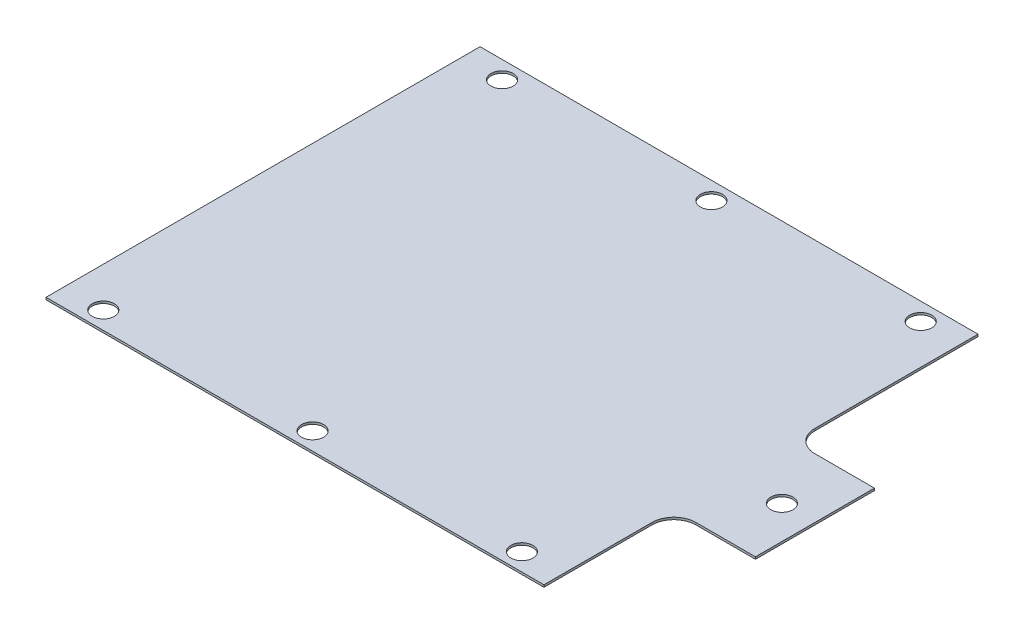
ISO-10303-21;
HEADER;
FILE_DESCRIPTION(('STEP AP214'),'2;1');
FILE_NAME('part.step','',(''),(''),'','','');
FILE_SCHEMA(('AUTOMOTIVE_DESIGN { 1 0 10303 214 1 1 1 1 }'));
ENDSEC;
DATA;
#1=APPLICATION_CONTEXT('core data for automotive mechanical design processes');
#2=APPLICATION_PROTOCOL_DEFINITION('international standard','automotive_design',2000,#1);
#3=PRODUCT_CONTEXT('',#1,'mechanical');
#4=PRODUCT('Part','Part','',(#3));
#5=PRODUCT_RELATED_PRODUCT_CATEGORY('part','',(#4));
#6=PRODUCT_DEFINITION_FORMATION('','',#4);
#7=PRODUCT_DEFINITION_CONTEXT('part definition',#1,'design');
#8=PRODUCT_DEFINITION('design','',#6,#7);
#9=PRODUCT_DEFINITION_SHAPE('','',#8);
#10=(LENGTH_UNIT() NAMED_UNIT(*) SI_UNIT(.MILLI.,.METRE.));
#11=(NAMED_UNIT(*) PLANE_ANGLE_UNIT() SI_UNIT($,.RADIAN.));
#12=(NAMED_UNIT(*) SI_UNIT($,.STERADIAN.) SOLID_ANGLE_UNIT());
#13=UNCERTAINTY_MEASURE_WITH_UNIT(LENGTH_MEASURE(1.E-05),#10,'distance_accuracy_value','');
#14=(GEOMETRIC_REPRESENTATION_CONTEXT(3) GLOBAL_UNCERTAINTY_ASSIGNED_CONTEXT((#13)) GLOBAL_UNIT_ASSIGNED_CONTEXT((#10,
#11,#12)) REPRESENTATION_CONTEXT('',''));
#15=CARTESIAN_POINT('',(0.,0.,0.));
#16=DIRECTION('',(0.,0.,1.));
#17=DIRECTION('',(1.,0.,0.));
#18=AXIS2_PLACEMENT_3D('',#15,#16,#17);
#19=CARTESIAN_POINT('',(0.,0.,0.));
#20=DIRECTION('',(0.,1.,0.));
#21=DIRECTION('',(0.,0.,1.));
#22=AXIS2_PLACEMENT_3D('',#19,#20,#21);
#23=PLANE('',#22);
#24=CARTESIAN_POINT('',(95.,0.,90.5));
#25=DIRECTION('',(0.,1.,0.));
#26=DIRECTION('',(0.,0.,1.));
#27=AXIS2_PLACEMENT_3D('',#24,#25,#26);
#28=CIRCLE('',#27,5.);
#29=CARTESIAN_POINT('',(95.,0.,95.5));
#30=VERTEX_POINT('',#29);
#31=EDGE_CURVE('E125',#30,#30,#28,.T.);
#32=ORIENTED_EDGE('',*,*,#31,.T.);
#33=EDGE_LOOP('',(#32));
#34=FACE_BOUND('',#33,.T.);
#35=CARTESIAN_POINT('',(0.,0.,90.5));
#36=DIRECTION('',(0.,1.,0.));
#37=DIRECTION('',(0.,0.,1.));
#38=AXIS2_PLACEMENT_3D('',#35,#36,#37);
#39=CIRCLE('',#38,5.);
#40=CARTESIAN_POINT('',(0.,0.,95.5));
#41=VERTEX_POINT('',#40);
#42=EDGE_CURVE('E201',#41,#41,#39,.T.);
#43=ORIENTED_EDGE('',*,*,#42,.T.);
#44=EDGE_LOOP('',(#43));
#45=FACE_BOUND('',#44,.T.);
#46=CARTESIAN_POINT('',(-95.,0.,90.5));
#47=DIRECTION('',(0.,1.,0.));
#48=DIRECTION('',(0.,0.,1.));
#49=AXIS2_PLACEMENT_3D('',#46,#47,#48);
#50=CIRCLE('',#49,5.);
#51=CARTESIAN_POINT('',(-95.,0.,95.5));
#52=VERTEX_POINT('',#51);
#53=EDGE_CURVE('E204',#52,#52,#50,.T.);
#54=ORIENTED_EDGE('',*,*,#53,.T.);
#55=EDGE_LOOP('',(#54));
#56=FACE_BOUND('',#55,.T.);
#57=CARTESIAN_POINT('',(135.,0.,12.5));
#58=DIRECTION('',(0.,1.,0.));
#59=DIRECTION('',(0.,0.,1.));
#60=AXIS2_PLACEMENT_3D('',#57,#58,#59);
#61=CIRCLE('',#60,5.);
#62=CARTESIAN_POINT('',(135.,0.,17.5));
#63=VERTEX_POINT('',#62);
#64=EDGE_CURVE('E207',#63,#63,#61,.T.);
#65=ORIENTED_EDGE('',*,*,#64,.T.);
#66=EDGE_LOOP('',(#65));
#67=FACE_BOUND('',#66,.T.);
#68=CARTESIAN_POINT('',(95.,0.,-90.5));
#69=DIRECTION('',(0.,1.,0.));
#70=DIRECTION('',(0.,0.,1.));
#71=AXIS2_PLACEMENT_3D('',#68,#69,#70);
#72=CIRCLE('',#71,5.);
#73=CARTESIAN_POINT('',(95.,0.,-85.5));
#74=VERTEX_POINT('',#73);
#75=EDGE_CURVE('E210',#74,#74,#72,.T.);
#76=ORIENTED_EDGE('',*,*,#75,.T.);
#77=EDGE_LOOP('',(#76));
#78=FACE_BOUND('',#77,.T.);
#79=CARTESIAN_POINT('',(0.,0.,-90.5));
#80=DIRECTION('',(0.,1.,0.));
#81=DIRECTION('',(0.,0.,1.));
#82=AXIS2_PLACEMENT_3D('',#79,#80,#81);
#83=CIRCLE('',#82,5.);
#84=CARTESIAN_POINT('',(0.,0.,-85.5));
#85=VERTEX_POINT('',#84);
#86=EDGE_CURVE('E213',#85,#85,#83,.T.);
#87=ORIENTED_EDGE('',*,*,#86,.T.);
#88=EDGE_LOOP('',(#87));
#89=FACE_BOUND('',#88,.T.);
#90=CARTESIAN_POINT('',(-95.,0.,-90.5));
#91=DIRECTION('',(0.,1.,0.));
#92=DIRECTION('',(0.,0.,1.));
#93=AXIS2_PLACEMENT_3D('',#90,#91,#92);
#94=CIRCLE('',#93,5.);
#95=CARTESIAN_POINT('',(-95.,0.,-85.5));
#96=VERTEX_POINT('',#95);
#97=EDGE_CURVE('E147',#96,#96,#94,.T.);
#98=ORIENTED_EDGE('',*,*,#97,.T.);
#99=EDGE_LOOP('',(#98));
#100=FACE_BOUND('',#99,.T.);
#101=DIRECTION('',(0.,0.,-1.));
#102=VECTOR('',#101,1.);
#103=CARTESIAN_POINT('',(113.,0.,-24.5));
#104=LINE('',#103,#102);
#105=CARTESIAN_POINT('',(113.,0.,-24.5));
#106=VERTEX_POINT('',#105);
#107=CARTESIAN_POINT('',(113.,0.,-98.5));
#108=VERTEX_POINT('',#107);
#109=EDGE_CURVE('E150',#106,#108,#104,.T.);
#110=ORIENTED_EDGE('',*,*,#109,.F.);
#111=CARTESIAN_POINT('',(123.,0.,-24.5));
#112=DIRECTION('',(0.,1.,0.));
#113=DIRECTION('',(0.,0.,1.));
#114=AXIS2_PLACEMENT_3D('',#111,#112,#113);
#115=CIRCLE('',#114,10.);
#116=CARTESIAN_POINT('',(123.,0.,-14.5));
#117=VERTEX_POINT('',#116);
#118=EDGE_CURVE('E162',#106,#117,#115,.T.);
#119=ORIENTED_EDGE('',*,*,#118,.T.);
#120=DIRECTION('',(-1.,0.,0.));
#121=VECTOR('',#120,1.);
#122=CARTESIAN_POINT('',(150.,0.,-14.5));
#123=LINE('',#122,#121);
#124=CARTESIAN_POINT('',(150.,0.,-14.5));
#125=VERTEX_POINT('',#124);
#126=EDGE_CURVE('E159',#125,#117,#123,.T.);
#127=ORIENTED_EDGE('',*,*,#126,.F.);
#128=DIRECTION('',(0.,0.,-1.));
#129=VECTOR('',#128,1.);
#130=CARTESIAN_POINT('',(150.,0.,39.5));
#131=LINE('',#130,#129);
#132=CARTESIAN_POINT('',(150.,0.,39.5));
#133=VERTEX_POINT('',#132);
#134=EDGE_CURVE('E166',#133,#125,#131,.T.);
#135=ORIENTED_EDGE('',*,*,#134,.F.);
#136=DIRECTION('',(1.,0.,0.));
#137=VECTOR('',#136,1.);
#138=CARTESIAN_POINT('',(123.,0.,39.5));
#139=LINE('',#138,#137);
#140=CARTESIAN_POINT('',(123.,0.,39.5));
#141=VERTEX_POINT('',#140);
#142=EDGE_CURVE('E99',#141,#133,#139,.T.);
#143=ORIENTED_EDGE('',*,*,#142,.F.);
#144=CARTESIAN_POINT('',(123.,0.,49.5));
#145=DIRECTION('',(0.,1.,0.));
#146=DIRECTION('',(0.,0.,1.));
#147=AXIS2_PLACEMENT_3D('',#144,#145,#146);
#148=CIRCLE('',#147,10.);
#149=CARTESIAN_POINT('',(113.,0.,49.5));
#150=VERTEX_POINT('',#149);
#151=EDGE_CURVE('E20',#141,#150,#148,.T.);
#152=ORIENTED_EDGE('',*,*,#151,.T.);
#153=DIRECTION('',(0.,0.,-1.));
#154=VECTOR('',#153,1.);
#155=CARTESIAN_POINT('',(113.,0.,98.5));
#156=LINE('',#155,#154);
#157=CARTESIAN_POINT('',(113.,0.,98.5));
#158=VERTEX_POINT('',#157);
#159=EDGE_CURVE('E96',#158,#150,#156,.T.);
#160=ORIENTED_EDGE('',*,*,#159,.F.);
#161=DIRECTION('',(1.,0.,0.));
#162=VECTOR('',#161,1.);
#163=CARTESIAN_POINT('',(-113.,0.,98.5));
#164=LINE('',#163,#162);
#165=CARTESIAN_POINT('',(-113.,0.,98.5));
#166=VERTEX_POINT('',#165);
#167=EDGE_CURVE('E118',#166,#158,#164,.T.);
#168=ORIENTED_EDGE('',*,*,#167,.F.);
#169=DIRECTION('',(0.,0.,1.));
#170=VECTOR('',#169,1.);
#171=CARTESIAN_POINT('',(-113.,0.,-98.5));
#172=LINE('',#171,#170);
#173=CARTESIAN_POINT('',(-113.,0.,-98.5));
#174=VERTEX_POINT('',#173);
#175=EDGE_CURVE('E144',#174,#166,#172,.T.);
#176=ORIENTED_EDGE('',*,*,#175,.F.);
#177=DIRECTION('',(-1.,0.,0.));
#178=VECTOR('',#177,1.);
#179=CARTESIAN_POINT('',(113.,0.,-98.5));
#180=LINE('',#179,#178);
#181=EDGE_CURVE('E131',#108,#174,#180,.T.);
#182=ORIENTED_EDGE('',*,*,#181,.F.);
#183=EDGE_LOOP('',(#110,#119,#127,#135,#143,#152,#160,#168,#176,#182));
#184=FACE_BOUND('',#183,.T.);
#185=ADVANCED_FACE('F17',(#34,#45,#56,#67,#78,#89,#100,#184),#23,.F.);
#186=CARTESIAN_POINT('',(-113.,0.,98.5));
#187=DIRECTION('',(0.,0.,1.));
#188=DIRECTION('',(1.,0.,0.));
#189=AXIS2_PLACEMENT_3D('',#186,#187,#188);
#190=PLANE('',#189);
#191=DIRECTION('',(0.,1.,0.));
#192=VECTOR('',#191,1.);
#193=CARTESIAN_POINT('',(-113.,0.,98.5));
#194=LINE('',#193,#192);
#195=CARTESIAN_POINT('',(-113.,1.,98.5));
#196=VERTEX_POINT('',#195);
#197=EDGE_CURVE('E128',#166,#196,#194,.T.);
#198=ORIENTED_EDGE('',*,*,#197,.F.);
#199=ORIENTED_EDGE('',*,*,#167,.T.);
#200=DIRECTION('',(0.,1.,0.));
#201=VECTOR('',#200,1.);
#202=CARTESIAN_POINT('',(113.,0.,98.5));
#203=LINE('',#202,#201);
#204=CARTESIAN_POINT('',(113.,1.,98.5));
#205=VERTEX_POINT('',#204);
#206=EDGE_CURVE('E106',#205,#158,#203,.F.);
#207=ORIENTED_EDGE('',*,*,#206,.F.);
#208=DIRECTION('',(1.,0.,0.));
#209=VECTOR('',#208,1.);
#210=CARTESIAN_POINT('',(0.,1.,98.5));
#211=LINE('',#210,#209);
#212=EDGE_CURVE('E121',#196,#205,#211,.T.);
#213=ORIENTED_EDGE('',*,*,#212,.F.);
#214=EDGE_LOOP('',(#198,#199,#207,#213));
#215=FACE_BOUND('',#214,.T.);
#216=ADVANCED_FACE('F436',(#215),#190,.T.);
#217=CARTESIAN_POINT('',(113.,0.,98.5));
#218=DIRECTION('',(1.,0.,0.));
#219=DIRECTION('',(0.,0.,-1.));
#220=AXIS2_PLACEMENT_3D('',#217,#218,#219);
#221=PLANE('',#220);
#222=ORIENTED_EDGE('',*,*,#206,.T.);
#223=ORIENTED_EDGE('',*,*,#159,.T.);
#224=DIRECTION('',(0.,1.,0.));
#225=VECTOR('',#224,1.);
#226=CARTESIAN_POINT('',(113.,0.,49.5));
#227=LINE('',#226,#225);
#228=CARTESIAN_POINT('',(113.,1.,49.5));
#229=VERTEX_POINT('',#228);
#230=EDGE_CURVE('E101',#150,#229,#227,.T.);
#231=ORIENTED_EDGE('',*,*,#230,.T.);
#232=DIRECTION('',(0.,0.,1.));
#233=VECTOR('',#232,1.);
#234=CARTESIAN_POINT('',(113.,1.,0.));
#235=LINE('',#234,#233);
#236=EDGE_CURVE('E124',#205,#229,#235,.F.);
#237=ORIENTED_EDGE('',*,*,#236,.F.);
#238=EDGE_LOOP('',(#222,#223,#231,#237));
#239=FACE_BOUND('',#238,.T.);
#240=ADVANCED_FACE('F103',(#239),#221,.T.);
#241=CARTESIAN_POINT('',(123.,0.,49.5));
#242=DIRECTION('',(0.,1.,0.));
#243=DIRECTION('',(0.,0.,1.));
#244=AXIS2_PLACEMENT_3D('',#241,#242,#243);
#245=CYLINDRICAL_SURFACE('',#244,10.);
#246=CARTESIAN_POINT('',(123.,1.,49.5));
#247=DIRECTION('',(0.,1.,0.));
#248=DIRECTION('',(0.,0.,1.));
#249=AXIS2_PLACEMENT_3D('',#246,#247,#248);
#250=CIRCLE('',#249,10.);
#251=CARTESIAN_POINT('',(123.,1.,39.5));
#252=VERTEX_POINT('',#251);
#253=EDGE_CURVE('E110',#229,#252,#250,.F.);
#254=ORIENTED_EDGE('',*,*,#253,.F.);
#255=ORIENTED_EDGE('',*,*,#230,.F.);
#256=ORIENTED_EDGE('',*,*,#151,.F.);
#257=DIRECTION('',(0.,1.,0.));
#258=VECTOR('',#257,1.);
#259=CARTESIAN_POINT('',(123.,0.,39.5));
#260=LINE('',#259,#258);
#261=EDGE_CURVE('E112',#252,#141,#260,.F.);
#262=ORIENTED_EDGE('',*,*,#261,.F.);
#263=EDGE_LOOP('',(#254,#255,#256,#262));
#264=FACE_BOUND('',#263,.T.);
#265=ADVANCED_FACE('F108',(#264),#245,.F.);
#266=CARTESIAN_POINT('',(123.,0.,39.5));
#267=DIRECTION('',(0.,0.,1.));
#268=DIRECTION('',(1.,0.,0.));
#269=AXIS2_PLACEMENT_3D('',#266,#267,#268);
#270=PLANE('',#269);
#271=ORIENTED_EDGE('',*,*,#261,.T.);
#272=ORIENTED_EDGE('',*,*,#142,.T.);
#273=DIRECTION('',(0.,1.,0.));
#274=VECTOR('',#273,1.);
#275=CARTESIAN_POINT('',(150.,0.,39.5));
#276=LINE('',#275,#274);
#277=CARTESIAN_POINT('',(150.,1.,39.5));
#278=VERTEX_POINT('',#277);
#279=EDGE_CURVE('E168',#278,#133,#276,.F.);
#280=ORIENTED_EDGE('',*,*,#279,.F.);
#281=DIRECTION('',(1.,0.,0.));
#282=VECTOR('',#281,1.);
#283=CARTESIAN_POINT('',(0.,1.,39.5));
#284=LINE('',#283,#282);
#285=EDGE_CURVE('E198',#252,#278,#284,.T.);
#286=ORIENTED_EDGE('',*,*,#285,.F.);
#287=EDGE_LOOP('',(#271,#272,#280,#286));
#288=FACE_BOUND('',#287,.T.);
#289=ADVANCED_FACE('F247',(#288),#270,.T.);
#290=CARTESIAN_POINT('',(150.,0.,39.5));
#291=DIRECTION('',(1.,0.,0.));
#292=DIRECTION('',(0.,0.,-1.));
#293=AXIS2_PLACEMENT_3D('',#290,#291,#292);
#294=PLANE('',#293);
#295=ORIENTED_EDGE('',*,*,#279,.T.);
#296=ORIENTED_EDGE('',*,*,#134,.T.);
#297=DIRECTION('',(0.,1.,0.));
#298=VECTOR('',#297,1.);
#299=CARTESIAN_POINT('',(150.,0.,-14.5));
#300=LINE('',#299,#298);
#301=CARTESIAN_POINT('',(150.,1.,-14.5));
#302=VERTEX_POINT('',#301);
#303=EDGE_CURVE('E163',#302,#125,#300,.F.);
#304=ORIENTED_EDGE('',*,*,#303,.F.);
#305=DIRECTION('',(0.,0.,1.));
#306=VECTOR('',#305,1.);
#307=CARTESIAN_POINT('',(150.,1.,0.));
#308=LINE('',#307,#306);
#309=EDGE_CURVE('E234',#278,#302,#308,.F.);
#310=ORIENTED_EDGE('',*,*,#309,.F.);
#311=EDGE_LOOP('',(#295,#296,#304,#310));
#312=FACE_BOUND('',#311,.T.);
#313=ADVANCED_FACE('F243',(#312),#294,.T.);
#314=CARTESIAN_POINT('',(150.,0.,-14.5));
#315=DIRECTION('',(0.,0.,-1.));
#316=DIRECTION('',(-1.,0.,0.));
#317=AXIS2_PLACEMENT_3D('',#314,#315,#316);
#318=PLANE('',#317);
#319=ORIENTED_EDGE('',*,*,#303,.T.);
#320=ORIENTED_EDGE('',*,*,#126,.T.);
#321=DIRECTION('',(0.,1.,0.));
#322=VECTOR('',#321,1.);
#323=CARTESIAN_POINT('',(123.,0.,-14.5));
#324=LINE('',#323,#322);
#325=CARTESIAN_POINT('',(123.,1.,-14.5));
#326=VERTEX_POINT('',#325);
#327=EDGE_CURVE('E217',#117,#326,#324,.T.);
#328=ORIENTED_EDGE('',*,*,#327,.T.);
#329=DIRECTION('',(1.,0.,0.));
#330=VECTOR('',#329,1.);
#331=CARTESIAN_POINT('',(0.,1.,-14.5));
#332=LINE('',#331,#330);
#333=EDGE_CURVE('E196',#302,#326,#332,.F.);
#334=ORIENTED_EDGE('',*,*,#333,.F.);
#335=EDGE_LOOP('',(#319,#320,#328,#334));
#336=FACE_BOUND('',#335,.T.);
#337=ADVANCED_FACE('F248',(#336),#318,.T.);
#338=CARTESIAN_POINT('',(123.,0.,-24.5));
#339=DIRECTION('',(0.,1.,0.));
#340=DIRECTION('',(0.,0.,1.));
#341=AXIS2_PLACEMENT_3D('',#338,#339,#340);
#342=CYLINDRICAL_SURFACE('',#341,10.);
#343=CARTESIAN_POINT('',(123.,1.,-24.5));
#344=DIRECTION('',(0.,1.,0.));
#345=DIRECTION('',(0.,0.,1.));
#346=AXIS2_PLACEMENT_3D('',#343,#344,#345);
#347=CIRCLE('',#346,10.);
#348=CARTESIAN_POINT('',(113.,1.,-24.5));
#349=VERTEX_POINT('',#348);
#350=EDGE_CURVE('E192',#326,#349,#347,.F.);
#351=ORIENTED_EDGE('',*,*,#350,.F.);
#352=ORIENTED_EDGE('',*,*,#327,.F.);
#353=ORIENTED_EDGE('',*,*,#118,.F.);
#354=DIRECTION('',(0.,1.,0.));
#355=VECTOR('',#354,1.);
#356=CARTESIAN_POINT('',(113.,0.,-24.5));
#357=LINE('',#356,#355);
#358=EDGE_CURVE('E153',#349,#106,#357,.F.);
#359=ORIENTED_EDGE('',*,*,#358,.F.);
#360=EDGE_LOOP('',(#351,#352,#353,#359));
#361=FACE_BOUND('',#360,.T.);
#362=ADVANCED_FACE('F281',(#361),#342,.F.);
#363=CARTESIAN_POINT('',(113.,0.,-24.5));
#364=DIRECTION('',(1.,0.,0.));
#365=DIRECTION('',(0.,0.,-1.));
#366=AXIS2_PLACEMENT_3D('',#363,#364,#365);
#367=PLANE('',#366);
#368=ORIENTED_EDGE('',*,*,#358,.T.);
#369=ORIENTED_EDGE('',*,*,#109,.T.);
#370=DIRECTION('',(0.,1.,0.));
#371=VECTOR('',#370,1.);
#372=CARTESIAN_POINT('',(113.,0.,-98.5));
#373=LINE('',#372,#371);
#374=CARTESIAN_POINT('',(113.,1.,-98.5));
#375=VERTEX_POINT('',#374);
#376=EDGE_CURVE('E152',#375,#108,#373,.F.);
#377=ORIENTED_EDGE('',*,*,#376,.F.);
#378=DIRECTION('',(0.,0.,1.));
#379=VECTOR('',#378,1.);
#380=CARTESIAN_POINT('',(113.,1.,0.));
#381=LINE('',#380,#379);
#382=EDGE_CURVE('E195',#349,#375,#381,.F.);
#383=ORIENTED_EDGE('',*,*,#382,.F.);
#384=EDGE_LOOP('',(#368,#369,#377,#383));
#385=FACE_BOUND('',#384,.T.);
#386=ADVANCED_FACE('F273',(#385),#367,.T.);
#387=CARTESIAN_POINT('',(113.,0.,-98.5));
#388=DIRECTION('',(0.,0.,-1.));
#389=DIRECTION('',(-1.,0.,0.));
#390=AXIS2_PLACEMENT_3D('',#387,#388,#389);
#391=PLANE('',#390);
#392=ORIENTED_EDGE('',*,*,#376,.T.);
#393=ORIENTED_EDGE('',*,*,#181,.T.);
#394=DIRECTION('',(0.,1.,0.));
#395=VECTOR('',#394,1.);
#396=CARTESIAN_POINT('',(-113.,0.,-98.5));
#397=LINE('',#396,#395);
#398=CARTESIAN_POINT('',(-113.,1.,-98.5));
#399=VERTEX_POINT('',#398);
#400=EDGE_CURVE('E35',#399,#174,#397,.F.);
#401=ORIENTED_EDGE('',*,*,#400,.F.);
#402=DIRECTION('',(1.,0.,0.));
#403=VECTOR('',#402,1.);
#404=CARTESIAN_POINT('',(0.,1.,-98.5));
#405=LINE('',#404,#403);
#406=EDGE_CURVE('E138',#375,#399,#405,.F.);
#407=ORIENTED_EDGE('',*,*,#406,.F.);
#408=EDGE_LOOP('',(#392,#393,#401,#407));
#409=FACE_BOUND('',#408,.T.);
#410=ADVANCED_FACE('F267',(#409),#391,.T.);
#411=CARTESIAN_POINT('',(-113.,0.,-98.5));
#412=DIRECTION('',(-1.,0.,0.));
#413=DIRECTION('',(0.,0.,1.));
#414=AXIS2_PLACEMENT_3D('',#411,#412,#413);
#415=PLANE('',#414);
#416=ORIENTED_EDGE('',*,*,#400,.T.);
#417=ORIENTED_EDGE('',*,*,#175,.T.);
#418=ORIENTED_EDGE('',*,*,#197,.T.);
#419=DIRECTION('',(0.,0.,1.));
#420=VECTOR('',#419,1.);
#421=CARTESIAN_POINT('',(-113.,1.,0.));
#422=LINE('',#421,#420);
#423=EDGE_CURVE('E134',#399,#196,#422,.T.);
#424=ORIENTED_EDGE('',*,*,#423,.F.);
#425=EDGE_LOOP('',(#416,#417,#418,#424));
#426=FACE_BOUND('',#425,.T.);
#427=ADVANCED_FACE('F276',(#426),#415,.T.);
#428=CARTESIAN_POINT('',(-95.,0.,-90.5));
#429=DIRECTION('',(0.,1.,0.));
#430=DIRECTION('',(0.,0.,1.));
#431=AXIS2_PLACEMENT_3D('',#428,#429,#430);
#432=CYLINDRICAL_SURFACE('',#431,5.);
#433=CARTESIAN_POINT('',(-95.,1.,-90.5));
#434=DIRECTION('',(0.,1.,0.));
#435=DIRECTION('',(0.,0.,1.));
#436=AXIS2_PLACEMENT_3D('',#433,#434,#435);
#437=CIRCLE('',#436,5.);
#438=CARTESIAN_POINT('',(-95.,1.,-85.5));
#439=VERTEX_POINT('',#438);
#440=EDGE_CURVE('E137',#439,#439,#437,.F.);
#441=ORIENTED_EDGE('',*,*,#440,.F.);
#442=EDGE_LOOP('',(#441));
#443=FACE_BOUND('',#442,.T.);
#444=ORIENTED_EDGE('',*,*,#97,.F.);
#445=EDGE_LOOP('',(#444));
#446=FACE_BOUND('',#445,.T.);
#447=ADVANCED_FACE('F321',(#443,#446),#432,.F.);
#448=CARTESIAN_POINT('',(0.,0.,-90.5));
#449=DIRECTION('',(0.,1.,0.));
#450=DIRECTION('',(0.,0.,1.));
#451=AXIS2_PLACEMENT_3D('',#448,#449,#450);
#452=CYLINDRICAL_SURFACE('',#451,5.);
#453=CARTESIAN_POINT('',(0.,1.,-90.5));
#454=DIRECTION('',(0.,1.,0.));
#455=DIRECTION('',(0.,0.,1.));
#456=AXIS2_PLACEMENT_3D('',#453,#454,#455);
#457=CIRCLE('',#456,5.);
#458=CARTESIAN_POINT('',(0.,1.,-85.5));
#459=VERTEX_POINT('',#458);
#460=EDGE_CURVE('E187',#459,#459,#457,.F.);
#461=ORIENTED_EDGE('',*,*,#460,.F.);
#462=EDGE_LOOP('',(#461));
#463=FACE_BOUND('',#462,.T.);
#464=ORIENTED_EDGE('',*,*,#86,.F.);
#465=EDGE_LOOP('',(#464));
#466=FACE_BOUND('',#465,.T.);
#467=ADVANCED_FACE('F317',(#463,#466),#452,.F.);
#468=CARTESIAN_POINT('',(95.,0.,-90.5));
#469=DIRECTION('',(0.,1.,0.));
#470=DIRECTION('',(0.,0.,1.));
#471=AXIS2_PLACEMENT_3D('',#468,#469,#470);
#472=CYLINDRICAL_SURFACE('',#471,5.);
#473=CARTESIAN_POINT('',(95.,1.,-90.5));
#474=DIRECTION('',(0.,1.,0.));
#475=DIRECTION('',(0.,0.,1.));
#476=AXIS2_PLACEMENT_3D('',#473,#474,#475);
#477=CIRCLE('',#476,5.);
#478=CARTESIAN_POINT('',(95.,1.,-85.5));
#479=VERTEX_POINT('',#478);
#480=EDGE_CURVE('E184',#479,#479,#477,.F.);
#481=ORIENTED_EDGE('',*,*,#480,.F.);
#482=EDGE_LOOP('',(#481));
#483=FACE_BOUND('',#482,.T.);
#484=ORIENTED_EDGE('',*,*,#75,.F.);
#485=EDGE_LOOP('',(#484));
#486=FACE_BOUND('',#485,.T.);
#487=ADVANCED_FACE('F313',(#483,#486),#472,.F.);
#488=CARTESIAN_POINT('',(135.,0.,12.5));
#489=DIRECTION('',(0.,1.,0.));
#490=DIRECTION('',(0.,0.,1.));
#491=AXIS2_PLACEMENT_3D('',#488,#489,#490);
#492=CYLINDRICAL_SURFACE('',#491,5.);
#493=CARTESIAN_POINT('',(135.,1.,12.5));
#494=DIRECTION('',(0.,1.,0.));
#495=DIRECTION('',(0.,0.,1.));
#496=AXIS2_PLACEMENT_3D('',#493,#494,#495);
#497=CIRCLE('',#496,5.);
#498=CARTESIAN_POINT('',(135.,1.,17.5));
#499=VERTEX_POINT('',#498);
#500=EDGE_CURVE('E181',#499,#499,#497,.F.);
#501=ORIENTED_EDGE('',*,*,#500,.F.);
#502=EDGE_LOOP('',(#501));
#503=FACE_BOUND('',#502,.T.);
#504=ORIENTED_EDGE('',*,*,#64,.F.);
#505=EDGE_LOOP('',(#504));
#506=FACE_BOUND('',#505,.T.);
#507=ADVANCED_FACE('F309',(#503,#506),#492,.F.);
#508=CARTESIAN_POINT('',(-95.,0.,90.5));
#509=DIRECTION('',(0.,1.,0.));
#510=DIRECTION('',(0.,0.,1.));
#511=AXIS2_PLACEMENT_3D('',#508,#509,#510);
#512=CYLINDRICAL_SURFACE('',#511,5.);
#513=CARTESIAN_POINT('',(-95.,1.,90.5));
#514=DIRECTION('',(0.,1.,0.));
#515=DIRECTION('',(0.,0.,1.));
#516=AXIS2_PLACEMENT_3D('',#513,#514,#515);
#517=CIRCLE('',#516,5.);
#518=CARTESIAN_POINT('',(-95.,1.,95.5));
#519=VERTEX_POINT('',#518);
#520=EDGE_CURVE('E178',#519,#519,#517,.F.);
#521=ORIENTED_EDGE('',*,*,#520,.F.);
#522=EDGE_LOOP('',(#521));
#523=FACE_BOUND('',#522,.T.);
#524=ORIENTED_EDGE('',*,*,#53,.F.);
#525=EDGE_LOOP('',(#524));
#526=FACE_BOUND('',#525,.T.);
#527=ADVANCED_FACE('F305',(#523,#526),#512,.F.);
#528=CARTESIAN_POINT('',(0.,0.,90.5));
#529=DIRECTION('',(0.,1.,0.));
#530=DIRECTION('',(0.,0.,1.));
#531=AXIS2_PLACEMENT_3D('',#528,#529,#530);
#532=CYLINDRICAL_SURFACE('',#531,5.);
#533=CARTESIAN_POINT('',(0.,1.,90.5));
#534=DIRECTION('',(0.,1.,0.));
#535=DIRECTION('',(0.,0.,1.));
#536=AXIS2_PLACEMENT_3D('',#533,#534,#535);
#537=CIRCLE('',#536,5.);
#538=CARTESIAN_POINT('',(0.,1.,95.5));
#539=VERTEX_POINT('',#538);
#540=EDGE_CURVE('E26',#539,#539,#537,.F.);
#541=ORIENTED_EDGE('',*,*,#540,.F.);
#542=EDGE_LOOP('',(#541));
#543=FACE_BOUND('',#542,.T.);
#544=ORIENTED_EDGE('',*,*,#42,.F.);
#545=EDGE_LOOP('',(#544));
#546=FACE_BOUND('',#545,.T.);
#547=ADVANCED_FACE('F298',(#543,#546),#532,.F.);
#548=CARTESIAN_POINT('',(95.,0.,90.5));
#549=DIRECTION('',(0.,1.,0.));
#550=DIRECTION('',(0.,0.,1.));
#551=AXIS2_PLACEMENT_3D('',#548,#549,#550);
#552=CYLINDRICAL_SURFACE('',#551,5.);
#553=CARTESIAN_POINT('',(95.,1.,90.5));
#554=DIRECTION('',(0.,1.,0.));
#555=DIRECTION('',(0.,0.,1.));
#556=AXIS2_PLACEMENT_3D('',#553,#554,#555);
#557=CIRCLE('',#556,5.);
#558=CARTESIAN_POINT('',(95.,1.,95.5));
#559=VERTEX_POINT('',#558);
#560=EDGE_CURVE('E11',#559,#559,#557,.F.);
#561=ORIENTED_EDGE('',*,*,#560,.F.);
#562=EDGE_LOOP('',(#561));
#563=FACE_BOUND('',#562,.T.);
#564=ORIENTED_EDGE('',*,*,#31,.F.);
#565=EDGE_LOOP('',(#564));
#566=FACE_BOUND('',#565,.T.);
#567=ADVANCED_FACE('F292',(#563,#566),#552,.F.);
#568=CARTESIAN_POINT('',(0.,1.,0.));
#569=DIRECTION('',(0.,1.,0.));
#570=DIRECTION('',(0.,0.,1.));
#571=AXIS2_PLACEMENT_3D('',#568,#569,#570);
#572=PLANE('',#571);
#573=ORIENTED_EDGE('',*,*,#560,.T.);
#574=EDGE_LOOP('',(#573));
#575=FACE_BOUND('',#574,.T.);
#576=ORIENTED_EDGE('',*,*,#540,.T.);
#577=EDGE_LOOP('',(#576));
#578=FACE_BOUND('',#577,.T.);
#579=ORIENTED_EDGE('',*,*,#520,.T.);
#580=EDGE_LOOP('',(#579));
#581=FACE_BOUND('',#580,.T.);
#582=ORIENTED_EDGE('',*,*,#500,.T.);
#583=EDGE_LOOP('',(#582));
#584=FACE_BOUND('',#583,.T.);
#585=ORIENTED_EDGE('',*,*,#480,.T.);
#586=EDGE_LOOP('',(#585));
#587=FACE_BOUND('',#586,.T.);
#588=ORIENTED_EDGE('',*,*,#460,.T.);
#589=EDGE_LOOP('',(#588));
#590=FACE_BOUND('',#589,.T.);
#591=ORIENTED_EDGE('',*,*,#440,.T.);
#592=EDGE_LOOP('',(#591));
#593=FACE_BOUND('',#592,.T.);
#594=ORIENTED_EDGE('',*,*,#406,.T.);
#595=ORIENTED_EDGE('',*,*,#423,.T.);
#596=ORIENTED_EDGE('',*,*,#212,.T.);
#597=ORIENTED_EDGE('',*,*,#236,.T.);
#598=ORIENTED_EDGE('',*,*,#253,.T.);
#599=ORIENTED_EDGE('',*,*,#285,.T.);
#600=ORIENTED_EDGE('',*,*,#309,.T.);
#601=ORIENTED_EDGE('',*,*,#333,.T.);
#602=ORIENTED_EDGE('',*,*,#350,.T.);
#603=ORIENTED_EDGE('',*,*,#382,.T.);
#604=EDGE_LOOP('',(#594,#595,#596,#597,#598,#599,#600,#601,#602,#603));
#605=FACE_BOUND('',#604,.T.);
#606=ADVANCED_FACE('F253',(#575,#578,#581,#584,#587,#590,#593,#605),#572,.T.);
#607=CLOSED_SHELL('',(#185,#216,#240,#265,#289,#313,#337,#362,#386,#410,#427,#447,#467,#487,
#507,#527,#547,#567,#606));
#608=MANIFOLD_SOLID_BREP('B1',#607);
#609=ADVANCED_BREP_SHAPE_REPRESENTATION('',(#18,#608),#14);
#610=SHAPE_DEFINITION_REPRESENTATION(#9,#609);
ENDSEC;
END-ISO-10303-21;
